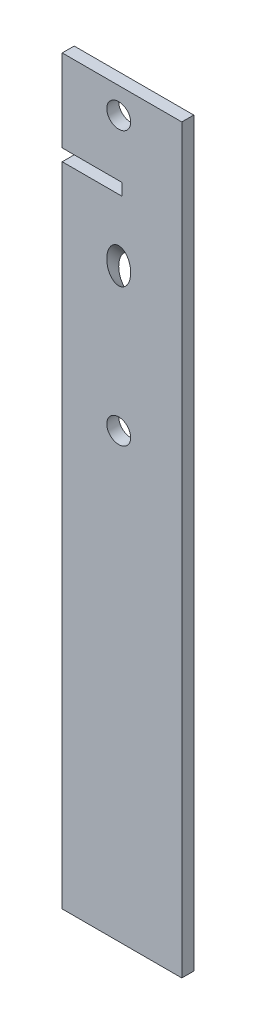
ISO-10303-21;
HEADER;
FILE_DESCRIPTION(('STEP AP214'),'2;1');
FILE_NAME('part.step','',(''),(''),'','','');
FILE_SCHEMA(('AUTOMOTIVE_DESIGN { 1 0 10303 214 1 1 1 1 }'));
ENDSEC;
DATA;
#1=APPLICATION_CONTEXT('core data for automotive mechanical design processes');
#2=APPLICATION_PROTOCOL_DEFINITION('international standard','automotive_design',2000,#1);
#3=PRODUCT_CONTEXT('',#1,'mechanical');
#4=PRODUCT('Part','Part','',(#3));
#5=PRODUCT_RELATED_PRODUCT_CATEGORY('part','',(#4));
#6=PRODUCT_DEFINITION_FORMATION('','',#4);
#7=PRODUCT_DEFINITION_CONTEXT('part definition',#1,'design');
#8=PRODUCT_DEFINITION('design','',#6,#7);
#9=PRODUCT_DEFINITION_SHAPE('','',#8);
#10=(LENGTH_UNIT() NAMED_UNIT(*) SI_UNIT(.MILLI.,.METRE.));
#11=(NAMED_UNIT(*) PLANE_ANGLE_UNIT() SI_UNIT($,.RADIAN.));
#12=(NAMED_UNIT(*) SI_UNIT($,.STERADIAN.) SOLID_ANGLE_UNIT());
#13=UNCERTAINTY_MEASURE_WITH_UNIT(LENGTH_MEASURE(1.E-05),#10,'distance_accuracy_value','');
#14=(GEOMETRIC_REPRESENTATION_CONTEXT(3) GLOBAL_UNCERTAINTY_ASSIGNED_CONTEXT((#13)) GLOBAL_UNIT_ASSIGNED_CONTEXT((#10,
#11,#12)) REPRESENTATION_CONTEXT('',''));
#15=CARTESIAN_POINT('',(0.,0.,0.));
#16=DIRECTION('',(0.,0.,1.));
#17=DIRECTION('',(1.,0.,0.));
#18=AXIS2_PLACEMENT_3D('',#15,#16,#17);
#19=CARTESIAN_POINT('',(2540.,317.5,-143.842086105115));
#20=DIRECTION('',(1.,0.,0.));
#21=DIRECTION('',(0.,0.,-1.));
#22=AXIS2_PLACEMENT_3D('',#19,#20,#21);
#23=PLANE('',#22);
#24=DIRECTION('',(0.,0.,1.));
#25=VECTOR('',#24,1.);
#26=CARTESIAN_POINT('',(2540.,217.4,-190.5));
#27=LINE('',#26,#25);
#28=CARTESIAN_POINT('',(2540.,217.4,-143.842086105115));
#29=VERTEX_POINT('',#28);
#30=CARTESIAN_POINT('',(2540.,217.4,-131.142086105115));
#31=VERTEX_POINT('',#30);
#32=EDGE_CURVE('E117',#29,#31,#27,.T.);
#33=ORIENTED_EDGE('',*,*,#32,.F.);
#34=DIRECTION('',(0.,-1.,0.));
#35=VECTOR('',#34,1.);
#36=CARTESIAN_POINT('',(2540.,317.5,-143.842086105115));
#37=LINE('',#36,#35);
#38=CARTESIAN_POINT('',(2540.,-469.9,-143.842086105115));
#39=VERTEX_POINT('',#38);
#40=EDGE_CURVE('E82',#29,#39,#37,.T.);
#41=ORIENTED_EDGE('',*,*,#40,.T.);
#42=DIRECTION('',(0.,0.,1.));
#43=VECTOR('',#42,1.);
#44=CARTESIAN_POINT('',(2540.,-469.9,-143.842086105115));
#45=LINE('',#44,#43);
#46=CARTESIAN_POINT('',(2540.,-469.9,-131.142086105115));
#47=VERTEX_POINT('',#46);
#48=EDGE_CURVE('E119',#39,#47,#45,.T.);
#49=ORIENTED_EDGE('',*,*,#48,.T.);
#50=DIRECTION('',(0.,-1.,0.));
#51=VECTOR('',#50,1.);
#52=CARTESIAN_POINT('',(2540.,317.5,-131.142086105115));
#53=LINE('',#52,#51);
#54=EDGE_CURVE('E61',#31,#47,#53,.T.);
#55=ORIENTED_EDGE('',*,*,#54,.F.);
#56=EDGE_LOOP('',(#33,#41,#49,#55));
#57=FACE_BOUND('',#56,.T.);
#58=ADVANCED_FACE('F37',(#57),#23,.F.);
#59=CARTESIAN_POINT('',(2540.,317.5,-143.842086105115));
#60=VERTEX_POINT('',#59);
#61=CARTESIAN_POINT('',(2540.,230.1,-143.842086105115));
#62=VERTEX_POINT('',#61);
#63=EDGE_CURVE('E163',#60,#62,#37,.T.);
#64=ORIENTED_EDGE('',*,*,#63,.T.);
#65=DIRECTION('',(0.,0.,1.));
#66=VECTOR('',#65,1.);
#67=CARTESIAN_POINT('',(2540.,230.1,-190.5));
#68=LINE('',#67,#66);
#69=CARTESIAN_POINT('',(2540.,230.1,-131.142086105115));
#70=VERTEX_POINT('',#69);
#71=EDGE_CURVE('E52',#62,#70,#68,.T.);
#72=ORIENTED_EDGE('',*,*,#71,.T.);
#73=CARTESIAN_POINT('',(2540.,317.5,-131.142086105115));
#74=VERTEX_POINT('',#73);
#75=EDGE_CURVE('E168',#74,#70,#53,.T.);
#76=ORIENTED_EDGE('',*,*,#75,.F.);
#77=DIRECTION('',(0.,0.,1.));
#78=VECTOR('',#77,1.);
#79=CARTESIAN_POINT('',(2540.,317.5,-143.842086105115));
#80=LINE('',#79,#78);
#81=EDGE_CURVE('E152',#60,#74,#80,.T.);
#82=ORIENTED_EDGE('',*,*,#81,.F.);
#83=EDGE_LOOP('',(#64,#72,#76,#82));
#84=FACE_BOUND('',#83,.T.);
#85=ADVANCED_FACE('F188',(#84),#23,.F.);
#86=CARTESIAN_POINT('',(2540.,317.5,-131.142086105115));
#87=DIRECTION('',(0.,0.,-1.));
#88=DIRECTION('',(-1.,0.,0.));
#89=AXIS2_PLACEMENT_3D('',#86,#87,#88);
#90=PLANE('',#89);
#91=CARTESIAN_POINT('',(2599.99999999996,289.999999999996,-131.142086105115));
#92=DIRECTION('',(0.,0.,-1.));
#93=DIRECTION('',(-1.,0.,0.));
#94=AXIS2_PLACEMENT_3D('',#91,#92,#93);
#95=CIRCLE('',#94,12.6999999999999);
#96=CARTESIAN_POINT('',(2587.29999999996,289.999999999996,-131.142086105115));
#97=VERTEX_POINT('',#96);
#98=EDGE_CURVE('E144',#97,#97,#95,.F.);
#99=ORIENTED_EDGE('',*,*,#98,.F.);
#100=EDGE_LOOP('',(#99));
#101=FACE_BOUND('',#100,.T.);
#102=ORIENTED_EDGE('',*,*,#75,.T.);
#103=DIRECTION('',(1.,0.,0.));
#104=VECTOR('',#103,1.);
#105=CARTESIAN_POINT('',(2540.,230.1,-131.142086105115));
#106=LINE('',#105,#104);
#107=CARTESIAN_POINT('',(2603.5,230.1,-131.142086105115));
#108=VERTEX_POINT('',#107);
#109=EDGE_CURVE('E120',#70,#108,#106,.T.);
#110=ORIENTED_EDGE('',*,*,#109,.T.);
#111=DIRECTION('',(0.,1.,0.));
#112=VECTOR('',#111,1.);
#113=CARTESIAN_POINT('',(2603.5,217.4,-131.142086105115));
#114=LINE('',#113,#112);
#115=CARTESIAN_POINT('',(2603.5,217.4,-131.142086105115));
#116=VERTEX_POINT('',#115);
#117=EDGE_CURVE('E125',#116,#108,#114,.T.);
#118=ORIENTED_EDGE('',*,*,#117,.F.);
#119=DIRECTION('',(1.,0.,0.));
#120=VECTOR('',#119,1.);
#121=CARTESIAN_POINT('',(2540.,217.4,-131.142086105115));
#122=LINE('',#121,#120);
#123=EDGE_CURVE('E112',#31,#116,#122,.T.);
#124=ORIENTED_EDGE('',*,*,#123,.F.);
#125=ORIENTED_EDGE('',*,*,#54,.T.);
#126=DIRECTION('',(1.,0.,0.));
#127=VECTOR('',#126,1.);
#128=CARTESIAN_POINT('',(2540.,-469.9,-131.142086105115));
#129=LINE('',#128,#127);
#130=CARTESIAN_POINT('',(2667.,-469.9,-131.142086105115));
#131=VERTEX_POINT('',#130);
#132=EDGE_CURVE('E161',#47,#131,#129,.T.);
#133=ORIENTED_EDGE('',*,*,#132,.T.);
#134=DIRECTION('',(0.,-1.,0.));
#135=VECTOR('',#134,1.);
#136=CARTESIAN_POINT('',(2667.,317.5,-131.142086105115));
#137=LINE('',#136,#135);
#138=CARTESIAN_POINT('',(2667.,317.5,-131.142086105115));
#139=VERTEX_POINT('',#138);
#140=EDGE_CURVE('E167',#139,#131,#137,.T.);
#141=ORIENTED_EDGE('',*,*,#140,.F.);
#142=DIRECTION('',(1.,0.,0.));
#143=VECTOR('',#142,1.);
#144=CARTESIAN_POINT('',(2540.,317.5,-131.142086105115));
#145=LINE('',#144,#143);
#146=EDGE_CURVE('E90',#74,#139,#145,.T.);
#147=ORIENTED_EDGE('',*,*,#146,.F.);
#148=EDGE_LOOP('',(#102,#110,#118,#124,#125,#133,#141,#147));
#149=FACE_BOUND('',#148,.T.);
#150=CARTESIAN_POINT('',(2599.99999999996,-1.09407005656713E-12,-131.142086105115));
#151=DIRECTION('',(0.,0.,-1.));
#152=DIRECTION('',(-1.,0.,0.));
#153=AXIS2_PLACEMENT_3D('',#150,#151,#152);
#154=CIRCLE('',#153,12.6999999999999);
#155=CARTESIAN_POINT('',(2587.29999999996,-1.09407005656713E-12,-131.142086105115));
#156=VERTEX_POINT('',#155);
#157=EDGE_CURVE('E145',#156,#156,#154,.F.);
#158=ORIENTED_EDGE('',*,*,#157,.F.);
#159=EDGE_LOOP('',(#158));
#160=FACE_BOUND('',#159,.T.);
#161=CARTESIAN_POINT('',(2599.99999999996,151.704709198241,-131.142086105115));
#162=DIRECTION('',(0.,0.,-1.));
#163=DIRECTION('',(0.,1.,0.));
#164=AXIS2_PLACEMENT_3D('',#161,#162,#163);
#165=ELLIPSE('',#164,18.4568454455695,12.6999999999999);
#166=CARTESIAN_POINT('',(2599.99999999996,170.161554643811,-131.142086105115));
#167=VERTEX_POINT('',#166);
#168=EDGE_CURVE('E143',#167,#167,#165,.F.);
#169=ORIENTED_EDGE('',*,*,#168,.F.);
#170=EDGE_LOOP('',(#169));
#171=FACE_BOUND('',#170,.T.);
#172=ADVANCED_FACE('F39',(#101,#149,#160,#171),#90,.F.);
#173=CARTESIAN_POINT('',(2667.,317.5,-143.842086105115));
#174=DIRECTION('',(-1.,0.,0.));
#175=DIRECTION('',(0.,0.,1.));
#176=AXIS2_PLACEMENT_3D('',#173,#174,#175);
#177=PLANE('',#176);
#178=DIRECTION('',(0.,0.,-1.));
#179=VECTOR('',#178,1.);
#180=CARTESIAN_POINT('',(2667.,-469.9,-143.842086105115));
#181=LINE('',#180,#179);
#182=CARTESIAN_POINT('',(2667.,-469.9,-143.842086105115));
#183=VERTEX_POINT('',#182);
#184=EDGE_CURVE('E164',#131,#183,#181,.T.);
#185=ORIENTED_EDGE('',*,*,#184,.T.);
#186=DIRECTION('',(0.,-1.,0.));
#187=VECTOR('',#186,1.);
#188=CARTESIAN_POINT('',(2667.,317.5,-143.842086105115));
#189=LINE('',#188,#187);
#190=CARTESIAN_POINT('',(2667.,317.5,-143.842086105115));
#191=VERTEX_POINT('',#190);
#192=EDGE_CURVE('E154',#191,#183,#189,.T.);
#193=ORIENTED_EDGE('',*,*,#192,.F.);
#194=DIRECTION('',(0.,0.,-1.));
#195=VECTOR('',#194,1.);
#196=CARTESIAN_POINT('',(2667.,317.5,-143.842086105115));
#197=LINE('',#196,#195);
#198=EDGE_CURVE('E156',#139,#191,#197,.T.);
#199=ORIENTED_EDGE('',*,*,#198,.F.);
#200=ORIENTED_EDGE('',*,*,#140,.T.);
#201=EDGE_LOOP('',(#185,#193,#199,#200));
#202=FACE_BOUND('',#201,.T.);
#203=ADVANCED_FACE('F197',(#202),#177,.F.);
#204=CARTESIAN_POINT('',(2540.,317.5,-143.842086105115));
#205=DIRECTION('',(0.,0.,1.));
#206=DIRECTION('',(1.,0.,0.));
#207=AXIS2_PLACEMENT_3D('',#204,#205,#206);
#208=PLANE('',#207);
#209=CARTESIAN_POINT('',(2599.99999999996,289.999999999996,-143.842086105115));
#210=DIRECTION('',(0.,0.,1.));
#211=DIRECTION('',(1.,0.,0.));
#212=AXIS2_PLACEMENT_3D('',#209,#210,#211);
#213=CIRCLE('',#212,12.6999999999999);
#214=CARTESIAN_POINT('',(2612.69999999996,289.999999999996,-143.842086105115));
#215=VERTEX_POINT('',#214);
#216=EDGE_CURVE('E148',#215,#215,#213,.F.);
#217=ORIENTED_EDGE('',*,*,#216,.F.);
#218=EDGE_LOOP('',(#217));
#219=FACE_BOUND('',#218,.T.);
#220=ORIENTED_EDGE('',*,*,#192,.T.);
#221=DIRECTION('',(-1.,0.,0.));
#222=VECTOR('',#221,1.);
#223=CARTESIAN_POINT('',(2540.,-469.9,-143.842086105115));
#224=LINE('',#223,#222);
#225=EDGE_CURVE('E169',#183,#39,#224,.T.);
#226=ORIENTED_EDGE('',*,*,#225,.T.);
#227=ORIENTED_EDGE('',*,*,#40,.F.);
#228=DIRECTION('',(-1.,0.,0.));
#229=VECTOR('',#228,1.);
#230=CARTESIAN_POINT('',(2540.,217.4,-143.842086105115));
#231=LINE('',#230,#229);
#232=CARTESIAN_POINT('',(2603.5,217.4,-143.842086105115));
#233=VERTEX_POINT('',#232);
#234=EDGE_CURVE('E11',#233,#29,#231,.T.);
#235=ORIENTED_EDGE('',*,*,#234,.F.);
#236=DIRECTION('',(0.,1.,0.));
#237=VECTOR('',#236,1.);
#238=CARTESIAN_POINT('',(2603.5,217.4,-143.842086105115));
#239=LINE('',#238,#237);
#240=CARTESIAN_POINT('',(2603.5,230.1,-143.842086105115));
#241=VERTEX_POINT('',#240);
#242=EDGE_CURVE('E128',#233,#241,#239,.T.);
#243=ORIENTED_EDGE('',*,*,#242,.T.);
#244=DIRECTION('',(-1.,0.,0.));
#245=VECTOR('',#244,1.);
#246=CARTESIAN_POINT('',(2540.,230.1,-143.842086105115));
#247=LINE('',#246,#245);
#248=EDGE_CURVE('E45',#241,#62,#247,.T.);
#249=ORIENTED_EDGE('',*,*,#248,.T.);
#250=ORIENTED_EDGE('',*,*,#63,.F.);
#251=DIRECTION('',(-1.,0.,0.));
#252=VECTOR('',#251,1.);
#253=CARTESIAN_POINT('',(2540.,317.5,-143.842086105115));
#254=LINE('',#253,#252);
#255=EDGE_CURVE('E158',#191,#60,#254,.T.);
#256=ORIENTED_EDGE('',*,*,#255,.F.);
#257=EDGE_LOOP('',(#220,#226,#227,#235,#243,#249,#250,#256));
#258=FACE_BOUND('',#257,.T.);
#259=CARTESIAN_POINT('',(2599.99999999996,138.311981925514,-143.842086105115));
#260=DIRECTION('',(0.,0.,1.));
#261=DIRECTION('',(0.,1.,0.));
#262=AXIS2_PLACEMENT_3D('',#259,#260,#261);
#263=ELLIPSE('',#262,18.4568454455695,12.6999999999999);
#264=CARTESIAN_POINT('',(2599.99999999996,156.768827371084,-143.842086105115));
#265=VERTEX_POINT('',#264);
#266=EDGE_CURVE('E140',#265,#265,#263,.F.);
#267=ORIENTED_EDGE('',*,*,#266,.F.);
#268=EDGE_LOOP('',(#267));
#269=FACE_BOUND('',#268,.T.);
#270=CARTESIAN_POINT('',(2599.99999999996,-9.97483853262698E-13,-143.842086105115));
#271=DIRECTION('',(0.,0.,1.));
#272=DIRECTION('',(1.,0.,0.));
#273=AXIS2_PLACEMENT_3D('',#270,#271,#272);
#274=CIRCLE('',#273,12.6999999999999);
#275=CARTESIAN_POINT('',(2612.69999999996,-9.97483853262698E-13,-143.842086105115));
#276=VERTEX_POINT('',#275);
#277=EDGE_CURVE('E149',#276,#276,#274,.F.);
#278=ORIENTED_EDGE('',*,*,#277,.F.);
#279=EDGE_LOOP('',(#278));
#280=FACE_BOUND('',#279,.T.);
#281=ADVANCED_FACE('F183',(#219,#258,#269,#280),#208,.F.);
#282=CARTESIAN_POINT('',(0.,317.5,0.));
#283=DIRECTION('',(0.,1.,0.));
#284=DIRECTION('',(0.,0.,1.));
#285=AXIS2_PLACEMENT_3D('',#282,#283,#284);
#286=PLANE('',#285);
#287=ORIENTED_EDGE('',*,*,#81,.T.);
#288=ORIENTED_EDGE('',*,*,#146,.T.);
#289=ORIENTED_EDGE('',*,*,#198,.T.);
#290=ORIENTED_EDGE('',*,*,#255,.T.);
#291=EDGE_LOOP('',(#287,#288,#289,#290));
#292=FACE_BOUND('',#291,.T.);
#293=ADVANCED_FACE('F190',(#292),#286,.T.);
#294=CARTESIAN_POINT('',(0.,-469.9,0.));
#295=DIRECTION('',(0.,1.,0.));
#296=DIRECTION('',(0.,0.,1.));
#297=AXIS2_PLACEMENT_3D('',#294,#295,#296);
#298=PLANE('',#297);
#299=ORIENTED_EDGE('',*,*,#48,.F.);
#300=ORIENTED_EDGE('',*,*,#225,.F.);
#301=ORIENTED_EDGE('',*,*,#184,.F.);
#302=ORIENTED_EDGE('',*,*,#132,.F.);
#303=EDGE_LOOP('',(#299,#300,#301,#302));
#304=FACE_BOUND('',#303,.T.);
#305=ADVANCED_FACE('F199',(#304),#298,.F.);
#306=CARTESIAN_POINT('',(2599.99999999996,0.,-275.000000000001));
#307=DIRECTION('',(0.,0.,1.));
#308=DIRECTION('',(0.,-1.,0.));
#309=AXIS2_PLACEMENT_3D('',#306,#307,#308);
#310=CYLINDRICAL_SURFACE('',#309,12.6999999999999);
#311=ORIENTED_EDGE('',*,*,#277,.T.);
#312=EDGE_LOOP('',(#311));
#313=FACE_BOUND('',#312,.T.);
#314=ORIENTED_EDGE('',*,*,#157,.T.);
#315=EDGE_LOOP('',(#314));
#316=FACE_BOUND('',#315,.T.);
#317=ADVANCED_FACE('F233',(#313,#316),#310,.F.);
#318=CARTESIAN_POINT('',(2599.99999999996,289.999999999996,275.));
#319=DIRECTION('',(0.,0.,-1.));
#320=DIRECTION('',(0.,1.,0.));
#321=AXIS2_PLACEMENT_3D('',#318,#319,#320);
#322=CYLINDRICAL_SURFACE('',#321,12.6999999999999);
#323=ORIENTED_EDGE('',*,*,#216,.T.);
#324=EDGE_LOOP('',(#323));
#325=FACE_BOUND('',#324,.T.);
#326=ORIENTED_EDGE('',*,*,#98,.T.);
#327=EDGE_LOOP('',(#326));
#328=FACE_BOUND('',#327,.T.);
#329=ADVANCED_FACE('F220',(#325,#328),#322,.F.);
#330=CARTESIAN_POINT('',(2599.99999999996,0.,-275.000000000001));
#331=DIRECTION('',(0.,0.725623851173429,0.688091583009297));
#332=DIRECTION('',(0.,-0.688091583009297,0.725623851173429));
#333=AXIS2_PLACEMENT_3D('',#330,#331,#332);
#334=CYLINDRICAL_SURFACE('',#333,12.6999999999999);
#335=ORIENTED_EDGE('',*,*,#266,.T.);
#336=EDGE_LOOP('',(#335));
#337=FACE_BOUND('',#336,.T.);
#338=ORIENTED_EDGE('',*,*,#168,.T.);
#339=EDGE_LOOP('',(#338));
#340=FACE_BOUND('',#339,.T.);
#341=ADVANCED_FACE('F209',(#337,#340),#334,.F.);
#342=CARTESIAN_POINT('',(0.,217.4,0.));
#343=DIRECTION('',(0.,1.,0.));
#344=DIRECTION('',(0.,0.,1.));
#345=AXIS2_PLACEMENT_3D('',#342,#343,#344);
#346=PLANE('',#345);
#347=ORIENTED_EDGE('',*,*,#123,.T.);
#348=DIRECTION('',(0.,0.,-1.));
#349=VECTOR('',#348,1.);
#350=CARTESIAN_POINT('',(2603.5,217.4,-131.142086105115));
#351=LINE('',#350,#349);
#352=EDGE_CURVE('E115',#116,#233,#351,.T.);
#353=ORIENTED_EDGE('',*,*,#352,.T.);
#354=ORIENTED_EDGE('',*,*,#234,.T.);
#355=ORIENTED_EDGE('',*,*,#32,.T.);
#356=EDGE_LOOP('',(#347,#353,#354,#355));
#357=FACE_BOUND('',#356,.T.);
#358=ADVANCED_FACE('F114',(#357),#346,.T.);
#359=CARTESIAN_POINT('',(0.,230.1,0.));
#360=DIRECTION('',(0.,1.,0.));
#361=DIRECTION('',(0.,0.,1.));
#362=AXIS2_PLACEMENT_3D('',#359,#360,#361);
#363=PLANE('',#362);
#364=ORIENTED_EDGE('',*,*,#71,.F.);
#365=ORIENTED_EDGE('',*,*,#248,.F.);
#366=DIRECTION('',(0.,0.,-1.));
#367=VECTOR('',#366,1.);
#368=CARTESIAN_POINT('',(2603.5,230.1,-131.142086105115));
#369=LINE('',#368,#367);
#370=EDGE_CURVE('E134',#108,#241,#369,.T.);
#371=ORIENTED_EDGE('',*,*,#370,.F.);
#372=ORIENTED_EDGE('',*,*,#109,.F.);
#373=EDGE_LOOP('',(#364,#365,#371,#372));
#374=FACE_BOUND('',#373,.T.);
#375=ADVANCED_FACE('F201',(#374),#363,.F.);
#376=CARTESIAN_POINT('',(2603.5,217.4,-131.142086105115));
#377=DIRECTION('',(1.,0.,0.));
#378=DIRECTION('',(0.,0.,-1.));
#379=AXIS2_PLACEMENT_3D('',#376,#377,#378);
#380=PLANE('',#379);
#381=ORIENTED_EDGE('',*,*,#370,.T.);
#382=ORIENTED_EDGE('',*,*,#242,.F.);
#383=ORIENTED_EDGE('',*,*,#352,.F.);
#384=ORIENTED_EDGE('',*,*,#117,.T.);
#385=EDGE_LOOP('',(#381,#382,#383,#384));
#386=FACE_BOUND('',#385,.T.);
#387=ADVANCED_FACE('F124',(#386),#380,.F.);
#388=CLOSED_SHELL('',(#58,#85,#172,#203,#281,#293,#305,#317,#329,#341,#358,#375,#387));
#389=MANIFOLD_SOLID_BREP('B2',#388);
#390=ADVANCED_BREP_SHAPE_REPRESENTATION('',(#18,#389),#14);
#391=SHAPE_DEFINITION_REPRESENTATION(#9,#390);
ENDSEC;
END-ISO-10303-21;
